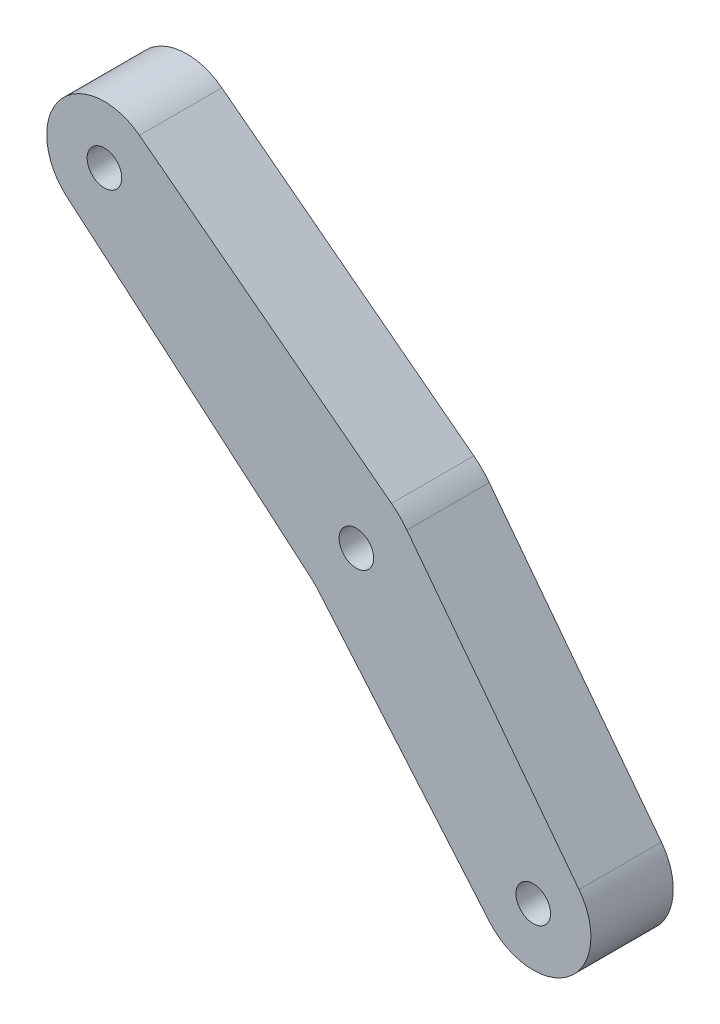
ISO-10303-21;
HEADER;
FILE_DESCRIPTION(('STEP AP214'),'2;1');
FILE_NAME('part.step','',(''),(''),'','','');
FILE_SCHEMA(('AUTOMOTIVE_DESIGN { 1 0 10303 214 1 1 1 1 }'));
ENDSEC;
DATA;
#1=APPLICATION_CONTEXT('core data for automotive mechanical design processes');
#2=APPLICATION_PROTOCOL_DEFINITION('international standard','automotive_design',2000,#1);
#3=PRODUCT_CONTEXT('',#1,'mechanical');
#4=PRODUCT('Part','Part','',(#3));
#5=PRODUCT_RELATED_PRODUCT_CATEGORY('part','',(#4));
#6=PRODUCT_DEFINITION_FORMATION('','',#4);
#7=PRODUCT_DEFINITION_CONTEXT('part definition',#1,'design');
#8=PRODUCT_DEFINITION('design','',#6,#7);
#9=PRODUCT_DEFINITION_SHAPE('','',#8);
#10=(LENGTH_UNIT() NAMED_UNIT(*) SI_UNIT(.MILLI.,.METRE.));
#11=(NAMED_UNIT(*) PLANE_ANGLE_UNIT() SI_UNIT($,.RADIAN.));
#12=(NAMED_UNIT(*) SI_UNIT($,.STERADIAN.) SOLID_ANGLE_UNIT());
#13=UNCERTAINTY_MEASURE_WITH_UNIT(LENGTH_MEASURE(1.E-05),#10,'distance_accuracy_value','');
#14=(GEOMETRIC_REPRESENTATION_CONTEXT(3) GLOBAL_UNCERTAINTY_ASSIGNED_CONTEXT((#13)) GLOBAL_UNIT_ASSIGNED_CONTEXT((#10,
#11,#12)) REPRESENTATION_CONTEXT('',''));
#15=CARTESIAN_POINT('',(0.,0.,0.));
#16=DIRECTION('',(0.,0.,1.));
#17=DIRECTION('',(1.,0.,0.));
#18=AXIS2_PLACEMENT_3D('',#15,#16,#17);
#19=CARTESIAN_POINT('',(-63.0537668880035,46.8405005939419,10.));
#20=DIRECTION('',(0.,0.,1.));
#21=DIRECTION('',(1.,0.,0.));
#22=AXIS2_PLACEMENT_3D('',#19,#20,#21);
#23=PLANE('',#22);
#24=CARTESIAN_POINT('',(-32.4724510234552,22.1569908736504,10.));
#25=DIRECTION('',(0.,0.,1.));
#26=DIRECTION('',(1.,0.,0.));
#27=AXIS2_PLACEMENT_3D('',#24,#25,#26);
#28=CIRCLE('',#27,2.1);
#29=CARTESIAN_POINT('',(-30.3724510234552,22.1569908736504,10.));
#30=VERTEX_POINT('',#29);
#31=EDGE_CURVE('E186',#30,#30,#28,.T.);
#32=ORIENTED_EDGE('',*,*,#31,.F.);
#33=EDGE_LOOP('',(#32));
#34=FACE_BOUND('',#33,.T.);
#35=CARTESIAN_POINT('',(-63.0537668880035,46.8405005939419,10.));
#36=DIRECTION('',(0.,0.,1.));
#37=DIRECTION('',(1.,0.,0.));
#38=AXIS2_PLACEMENT_3D('',#35,#36,#37);
#39=CIRCLE('',#38,7.00000000000004);
#40=CARTESIAN_POINT('',(-58.8013103124301,52.4007715471296,10.));
#41=VERTEX_POINT('',#40);
#42=CARTESIAN_POINT('',(-67.5913977169374,41.5104061801149,10.));
#43=VERTEX_POINT('',#42);
#44=EDGE_CURVE('E149',#41,#43,#39,.T.);
#45=ORIENTED_EDGE('',*,*,#44,.T.);
#46=DIRECTION('',(0.761442059118128,-0.648232975561985,0.));
#47=VECTOR('',#46,1.);
#48=CARTESIAN_POINT('',(-38.1456106432029,16.4425366764547,10.));
#49=LINE('',#48,#47);
#50=CARTESIAN_POINT('',(-38.1456106432029,16.4425366764547,10.));
#51=VERTEX_POINT('',#50);
#52=EDGE_CURVE('E97',#43,#51,#49,.T.);
#53=ORIENTED_EDGE('',*,*,#52,.T.);
#54=CARTESIAN_POINT('',(-44.6279403988221,8.82811608527413,10.));
#55=DIRECTION('',(0.,0.,-1.));
#56=DIRECTION('',(1.,0.,0.));
#57=AXIS2_PLACEMENT_3D('',#54,#55,#56);
#58=CIRCLE('',#57,9.99999999999906);
#59=CARTESIAN_POINT('',(-37.0116183844897,15.3082116844128,10.));
#60=VERTEX_POINT('',#59);
#61=EDGE_CURVE('E164',#51,#60,#58,.T.);
#62=ORIENTED_EDGE('',*,*,#61,.T.);
#63=DIRECTION('',(0.648009559913943,-0.761632201433302,0.));
#64=VECTOR('',#63,1.);
#65=CARTESIAN_POINT('',(-16.3314254100331,-8.9980669193976,10.));
#66=LINE('',#65,#64);
#67=CARTESIAN_POINT('',(-16.3314254100331,-8.99806691939761,10.));
#68=VERTEX_POINT('',#67);
#69=EDGE_CURVE('E177',#60,#68,#66,.T.);
#70=ORIENTED_EDGE('',*,*,#69,.T.);
#71=CARTESIAN_POINT('',(-11.,-4.462,10.));
#72=DIRECTION('',(0.,0.,1.));
#73=DIRECTION('',(-1.,0.,0.));
#74=AXIS2_PLACEMENT_3D('',#71,#72,#73);
#75=CIRCLE('',#74,7.);
#76=CARTESIAN_POINT('',(-5.43848172339126,-0.211174849638371,10.));
#77=VERTEX_POINT('',#76);
#78=EDGE_CURVE('E116',#68,#77,#75,.T.);
#79=ORIENTED_EDGE('',*,*,#78,.T.);
#80=DIRECTION('',(-0.607260735765947,0.794502610944105,0.));
#81=VECTOR('',#80,1.);
#82=CARTESIAN_POINT('',(-5.43848172339126,-0.211174849638371,10.));
#83=LINE('',#82,#81);
#84=CARTESIAN_POINT('',(-26.3383332016894,27.1329058555101,10.));
#85=VERTEX_POINT('',#84);
#86=EDGE_CURVE('E110',#77,#85,#83,.T.);
#87=ORIENTED_EDGE('',*,*,#86,.T.);
#88=CARTESIAN_POINT('',(-34.2833593111308,21.0602984978504,10.));
#89=DIRECTION('',(0.,0.,1.));
#90=DIRECTION('',(1.,0.,0.));
#91=AXIS2_PLACEMENT_3D('',#88,#89,#90);
#92=CIRCLE('',#91,10.0000000000004);
#93=CARTESIAN_POINT('',(-28.2084213460255,29.0035427166901,10.));
#94=VERTEX_POINT('',#93);
#95=EDGE_CURVE('E114',#85,#94,#92,.T.);
#96=ORIENTED_EDGE('',*,*,#95,.T.);
#97=DIRECTION('',(-0.794324421883945,0.607493796510497,0.));
#98=VECTOR('',#97,1.);
#99=CARTESIAN_POINT('',(-58.8013103124301,52.4007715471296,10.));
#100=LINE('',#99,#98);
#101=EDGE_CURVE('E54',#94,#41,#100,.T.);
#102=ORIENTED_EDGE('',*,*,#101,.T.);
#103=EDGE_LOOP('',(#45,#53,#62,#70,#79,#87,#96,#102));
#104=FACE_BOUND('',#103,.T.);
#105=CARTESIAN_POINT('',(-63.0537668880035,46.8405005939419,10.));
#106=DIRECTION('',(0.,0.,1.));
#107=DIRECTION('',(1.,0.,0.));
#108=AXIS2_PLACEMENT_3D('',#105,#106,#107);
#109=CIRCLE('',#108,2.1);
#110=CARTESIAN_POINT('',(-60.9537668880035,46.8405005939419,10.));
#111=VERTEX_POINT('',#110);
#112=EDGE_CURVE('E138',#111,#111,#109,.T.);
#113=ORIENTED_EDGE('',*,*,#112,.F.);
#114=EDGE_LOOP('',(#113));
#115=FACE_BOUND('',#114,.T.);
#116=CARTESIAN_POINT('',(-11.,-4.462,10.));
#117=DIRECTION('',(0.,0.,1.));
#118=DIRECTION('',(1.,0.,0.));
#119=AXIS2_PLACEMENT_3D('',#116,#117,#118);
#120=CIRCLE('',#119,2.1);
#121=CARTESIAN_POINT('',(-8.9,-4.462,10.));
#122=VERTEX_POINT('',#121);
#123=EDGE_CURVE('E192',#122,#122,#120,.T.);
#124=ORIENTED_EDGE('',*,*,#123,.F.);
#125=EDGE_LOOP('',(#124));
#126=FACE_BOUND('',#125,.T.);
#127=ADVANCED_FACE('F37',(#34,#104,#115,#126),#23,.T.);
#128=CARTESIAN_POINT('',(-63.0537668880035,46.8405005939419,0.));
#129=DIRECTION('',(0.,0.,1.));
#130=DIRECTION('',(1.,0.,0.));
#131=AXIS2_PLACEMENT_3D('',#128,#129,#130);
#132=PLANE('',#131);
#133=CARTESIAN_POINT('',(-63.0537668880035,46.8405005939419,0.));
#134=DIRECTION('',(0.,0.,1.));
#135=DIRECTION('',(1.,0.,0.));
#136=AXIS2_PLACEMENT_3D('',#133,#134,#135);
#137=CIRCLE('',#136,7.00000000000004);
#138=CARTESIAN_POINT('',(-58.8013103124301,52.4007715471296,0.));
#139=VERTEX_POINT('',#138);
#140=CARTESIAN_POINT('',(-67.5913977169374,41.5104061801149,0.));
#141=VERTEX_POINT('',#140);
#142=EDGE_CURVE('E134',#139,#141,#137,.T.);
#143=ORIENTED_EDGE('',*,*,#142,.F.);
#144=DIRECTION('',(-0.794324421883945,0.607493796510497,0.));
#145=VECTOR('',#144,1.);
#146=CARTESIAN_POINT('',(-58.8013103124301,52.4007715471296,0.));
#147=LINE('',#146,#145);
#148=CARTESIAN_POINT('',(-28.2084213460255,29.0035427166901,0.));
#149=VERTEX_POINT('',#148);
#150=EDGE_CURVE('E89',#149,#139,#147,.T.);
#151=ORIENTED_EDGE('',*,*,#150,.F.);
#152=CARTESIAN_POINT('',(-34.2833593111308,21.0602984978504,0.));
#153=DIRECTION('',(0.,0.,1.));
#154=DIRECTION('',(1.,0.,0.));
#155=AXIS2_PLACEMENT_3D('',#152,#153,#154);
#156=CIRCLE('',#155,10.0000000000004);
#157=CARTESIAN_POINT('',(-26.3383332016894,27.1329058555101,0.));
#158=VERTEX_POINT('',#157);
#159=EDGE_CURVE('E83',#158,#149,#156,.T.);
#160=ORIENTED_EDGE('',*,*,#159,.F.);
#161=DIRECTION('',(-0.607260735765947,0.794502610944105,0.));
#162=VECTOR('',#161,1.);
#163=CARTESIAN_POINT('',(-5.43848172339126,-0.211174849638371,0.));
#164=LINE('',#163,#162);
#165=CARTESIAN_POINT('',(-5.43848172339126,-0.211174849638371,0.));
#166=VERTEX_POINT('',#165);
#167=EDGE_CURVE('E124',#166,#158,#164,.T.);
#168=ORIENTED_EDGE('',*,*,#167,.F.);
#169=CARTESIAN_POINT('',(-11.,-4.462,0.));
#170=DIRECTION('',(0.,0.,1.));
#171=DIRECTION('',(-1.,0.,0.));
#172=AXIS2_PLACEMENT_3D('',#169,#170,#171);
#173=CIRCLE('',#172,7.);
#174=CARTESIAN_POINT('',(-16.3314254100331,-8.99806691939761,0.));
#175=VERTEX_POINT('',#174);
#176=EDGE_CURVE('E144',#175,#166,#173,.T.);
#177=ORIENTED_EDGE('',*,*,#176,.F.);
#178=DIRECTION('',(0.648009559913943,-0.761632201433302,0.));
#179=VECTOR('',#178,1.);
#180=CARTESIAN_POINT('',(-16.3314254100331,-8.9980669193976,0.));
#181=LINE('',#180,#179);
#182=CARTESIAN_POINT('',(-37.0116183844897,15.3082116844128,0.));
#183=VERTEX_POINT('',#182);
#184=EDGE_CURVE('E142',#183,#175,#181,.T.);
#185=ORIENTED_EDGE('',*,*,#184,.F.);
#186=CARTESIAN_POINT('',(-44.6279403988221,8.82811608527413,0.));
#187=DIRECTION('',(0.,0.,-1.));
#188=DIRECTION('',(1.,0.,0.));
#189=AXIS2_PLACEMENT_3D('',#186,#187,#188);
#190=CIRCLE('',#189,9.99999999999906);
#191=CARTESIAN_POINT('',(-38.1456106432029,16.4425366764547,0.));
#192=VERTEX_POINT('',#191);
#193=EDGE_CURVE('E140',#192,#183,#190,.T.);
#194=ORIENTED_EDGE('',*,*,#193,.F.);
#195=DIRECTION('',(0.761442059118128,-0.648232975561985,0.));
#196=VECTOR('',#195,1.);
#197=CARTESIAN_POINT('',(-38.1456106432029,16.4425366764547,0.));
#198=LINE('',#197,#196);
#199=EDGE_CURVE('E137',#141,#192,#198,.T.);
#200=ORIENTED_EDGE('',*,*,#199,.F.);
#201=EDGE_LOOP('',(#143,#151,#160,#168,#177,#185,#194,#200));
#202=FACE_BOUND('',#201,.T.);
#203=CARTESIAN_POINT('',(-63.0537668880035,46.8405005939419,0.));
#204=DIRECTION('',(0.,0.,1.));
#205=DIRECTION('',(1.,0.,0.));
#206=AXIS2_PLACEMENT_3D('',#203,#204,#205);
#207=CIRCLE('',#206,2.1);
#208=CARTESIAN_POINT('',(-60.9537668880035,46.8405005939419,0.));
#209=VERTEX_POINT('',#208);
#210=EDGE_CURVE('E183',#209,#209,#207,.T.);
#211=ORIENTED_EDGE('',*,*,#210,.T.);
#212=EDGE_LOOP('',(#211));
#213=FACE_BOUND('',#212,.T.);
#214=CARTESIAN_POINT('',(-32.4724510234552,22.1569908736504,0.));
#215=DIRECTION('',(0.,0.,1.));
#216=DIRECTION('',(1.,0.,0.));
#217=AXIS2_PLACEMENT_3D('',#214,#215,#216);
#218=CIRCLE('',#217,2.1);
#219=CARTESIAN_POINT('',(-30.3724510234552,22.1569908736504,0.));
#220=VERTEX_POINT('',#219);
#221=EDGE_CURVE('E189',#220,#220,#218,.T.);
#222=ORIENTED_EDGE('',*,*,#221,.T.);
#223=EDGE_LOOP('',(#222));
#224=FACE_BOUND('',#223,.T.);
#225=CARTESIAN_POINT('',(-11.,-4.462,0.));
#226=DIRECTION('',(0.,0.,1.));
#227=DIRECTION('',(1.,0.,0.));
#228=AXIS2_PLACEMENT_3D('',#225,#226,#227);
#229=CIRCLE('',#228,2.1);
#230=CARTESIAN_POINT('',(-8.9,-4.462,0.));
#231=VERTEX_POINT('',#230);
#232=EDGE_CURVE('E195',#231,#231,#229,.T.);
#233=ORIENTED_EDGE('',*,*,#232,.T.);
#234=EDGE_LOOP('',(#233));
#235=FACE_BOUND('',#234,.T.);
#236=ADVANCED_FACE('F168',(#202,#213,#224,#235),#132,.F.);
#237=CARTESIAN_POINT('',(-63.0537668880035,46.8405005939419,10.));
#238=DIRECTION('',(0.,0.,-1.));
#239=DIRECTION('',(-1.,0.,0.));
#240=AXIS2_PLACEMENT_3D('',#237,#238,#239);
#241=CYLINDRICAL_SURFACE('',#240,7.00000000000004);
#242=ORIENTED_EDGE('',*,*,#142,.T.);
#243=DIRECTION('',(0.,0.,-1.));
#244=VECTOR('',#243,1.);
#245=CARTESIAN_POINT('',(-67.5913977169374,41.5104061801149,10.));
#246=LINE('',#245,#244);
#247=EDGE_CURVE('E11',#43,#141,#246,.T.);
#248=ORIENTED_EDGE('',*,*,#247,.F.);
#249=ORIENTED_EDGE('',*,*,#44,.F.);
#250=DIRECTION('',(0.,0.,-1.));
#251=VECTOR('',#250,1.);
#252=CARTESIAN_POINT('',(-58.8013103124301,52.4007715471296,10.));
#253=LINE('',#252,#251);
#254=EDGE_CURVE('E130',#41,#139,#253,.T.);
#255=ORIENTED_EDGE('',*,*,#254,.T.);
#256=EDGE_LOOP('',(#242,#248,#249,#255));
#257=FACE_BOUND('',#256,.T.);
#258=ADVANCED_FACE('F39',(#257),#241,.T.);
#259=CARTESIAN_POINT('',(-38.1456106432029,16.4425366764547,10.));
#260=DIRECTION('',(0.648232975561985,0.761442059118128,0.));
#261=DIRECTION('',(-0.761442059118128,0.648232975561985,0.));
#262=AXIS2_PLACEMENT_3D('',#259,#260,#261);
#263=PLANE('',#262);
#264=ORIENTED_EDGE('',*,*,#199,.T.);
#265=DIRECTION('',(0.,0.,-1.));
#266=VECTOR('',#265,1.);
#267=CARTESIAN_POINT('',(-38.1456106432029,16.4425366764547,10.));
#268=LINE('',#267,#266);
#269=EDGE_CURVE('E46',#51,#192,#268,.T.);
#270=ORIENTED_EDGE('',*,*,#269,.F.);
#271=ORIENTED_EDGE('',*,*,#52,.F.);
#272=ORIENTED_EDGE('',*,*,#247,.T.);
#273=EDGE_LOOP('',(#264,#270,#271,#272));
#274=FACE_BOUND('',#273,.T.);
#275=ADVANCED_FACE('F228',(#274),#263,.F.);
#276=CARTESIAN_POINT('',(-44.6279403988221,8.82811608527413,10.));
#277=DIRECTION('',(0.,0.,-1.));
#278=DIRECTION('',(-1.,0.,0.));
#279=AXIS2_PLACEMENT_3D('',#276,#277,#278);
#280=CYLINDRICAL_SURFACE('',#279,9.99999999999906);
#281=ORIENTED_EDGE('',*,*,#193,.T.);
#282=DIRECTION('',(0.,0.,-1.));
#283=VECTOR('',#282,1.);
#284=CARTESIAN_POINT('',(-37.0116183844897,15.3082116844128,10.));
#285=LINE('',#284,#283);
#286=EDGE_CURVE('E156',#60,#183,#285,.T.);
#287=ORIENTED_EDGE('',*,*,#286,.F.);
#288=ORIENTED_EDGE('',*,*,#61,.F.);
#289=ORIENTED_EDGE('',*,*,#269,.T.);
#290=EDGE_LOOP('',(#281,#287,#288,#289));
#291=FACE_BOUND('',#290,.T.);
#292=ADVANCED_FACE('F162',(#291),#280,.F.);
#293=CARTESIAN_POINT('',(-16.3314254100331,-8.9980669193976,10.));
#294=DIRECTION('',(0.761632201433302,0.648009559913943,0.));
#295=DIRECTION('',(-0.648009559913943,0.761632201433302,0.));
#296=AXIS2_PLACEMENT_3D('',#293,#294,#295);
#297=PLANE('',#296);
#298=ORIENTED_EDGE('',*,*,#184,.T.);
#299=DIRECTION('',(0.,0.,-1.));
#300=VECTOR('',#299,1.);
#301=CARTESIAN_POINT('',(-16.3314254100331,-8.99806691939761,10.));
#302=LINE('',#301,#300);
#303=EDGE_CURVE('E153',#68,#175,#302,.T.);
#304=ORIENTED_EDGE('',*,*,#303,.F.);
#305=ORIENTED_EDGE('',*,*,#69,.F.);
#306=ORIENTED_EDGE('',*,*,#286,.T.);
#307=EDGE_LOOP('',(#298,#304,#305,#306));
#308=FACE_BOUND('',#307,.T.);
#309=ADVANCED_FACE('F173',(#308),#297,.F.);
#310=CARTESIAN_POINT('',(-11.,-4.462,10.));
#311=DIRECTION('',(0.,0.,-1.));
#312=DIRECTION('',(-1.,0.,0.));
#313=AXIS2_PLACEMENT_3D('',#310,#311,#312);
#314=CYLINDRICAL_SURFACE('',#313,7.);
#315=ORIENTED_EDGE('',*,*,#176,.T.);
#316=DIRECTION('',(0.,0.,-1.));
#317=VECTOR('',#316,1.);
#318=CARTESIAN_POINT('',(-5.43848172339126,-0.211174849638371,10.));
#319=LINE('',#318,#317);
#320=EDGE_CURVE('E125',#77,#166,#319,.T.);
#321=ORIENTED_EDGE('',*,*,#320,.F.);
#322=ORIENTED_EDGE('',*,*,#78,.F.);
#323=ORIENTED_EDGE('',*,*,#303,.T.);
#324=EDGE_LOOP('',(#315,#321,#322,#323));
#325=FACE_BOUND('',#324,.T.);
#326=ADVANCED_FACE('F176',(#325),#314,.T.);
#327=CARTESIAN_POINT('',(-5.43848172339126,-0.211174849638371,10.));
#328=DIRECTION('',(-0.794502610944105,-0.607260735765947,0.));
#329=DIRECTION('',(0.607260735765947,-0.794502610944106,0.));
#330=AXIS2_PLACEMENT_3D('',#327,#328,#329);
#331=PLANE('',#330);
#332=ORIENTED_EDGE('',*,*,#167,.T.);
#333=DIRECTION('',(0.,0.,-1.));
#334=VECTOR('',#333,1.);
#335=CARTESIAN_POINT('',(-26.3383332016894,27.1329058555101,10.));
#336=LINE('',#335,#334);
#337=EDGE_CURVE('E121',#85,#158,#336,.T.);
#338=ORIENTED_EDGE('',*,*,#337,.F.);
#339=ORIENTED_EDGE('',*,*,#86,.F.);
#340=ORIENTED_EDGE('',*,*,#320,.T.);
#341=EDGE_LOOP('',(#332,#338,#339,#340));
#342=FACE_BOUND('',#341,.T.);
#343=ADVANCED_FACE('F122',(#342),#331,.F.);
#344=CARTESIAN_POINT('',(-34.2833593111308,21.0602984978504,10.));
#345=DIRECTION('',(0.,0.,-1.));
#346=DIRECTION('',(-1.,0.,0.));
#347=AXIS2_PLACEMENT_3D('',#344,#345,#346);
#348=CYLINDRICAL_SURFACE('',#347,10.0000000000004);
#349=ORIENTED_EDGE('',*,*,#159,.T.);
#350=DIRECTION('',(0.,0.,-1.));
#351=VECTOR('',#350,1.);
#352=CARTESIAN_POINT('',(-28.2084213460255,29.0035427166901,10.));
#353=LINE('',#352,#351);
#354=EDGE_CURVE('E126',#94,#149,#353,.T.);
#355=ORIENTED_EDGE('',*,*,#354,.F.);
#356=ORIENTED_EDGE('',*,*,#95,.F.);
#357=ORIENTED_EDGE('',*,*,#337,.T.);
#358=EDGE_LOOP('',(#349,#355,#356,#357));
#359=FACE_BOUND('',#358,.T.);
#360=ADVANCED_FACE('F128',(#359),#348,.T.);
#361=CARTESIAN_POINT('',(-58.8013103124301,52.4007715471296,10.));
#362=DIRECTION('',(-0.607493796510497,-0.794324421883945,0.));
#363=DIRECTION('',(0.794324421883945,-0.607493796510497,0.));
#364=AXIS2_PLACEMENT_3D('',#361,#362,#363);
#365=PLANE('',#364);
#366=ORIENTED_EDGE('',*,*,#150,.T.);
#367=ORIENTED_EDGE('',*,*,#254,.F.);
#368=ORIENTED_EDGE('',*,*,#101,.F.);
#369=ORIENTED_EDGE('',*,*,#354,.T.);
#370=EDGE_LOOP('',(#366,#367,#368,#369));
#371=FACE_BOUND('',#370,.T.);
#372=ADVANCED_FACE('F216',(#371),#365,.F.);
#373=CARTESIAN_POINT('',(-63.0537668880035,46.8405005939419,10.));
#374=DIRECTION('',(0.,0.,-1.));
#375=DIRECTION('',(-1.,0.,0.));
#376=AXIS2_PLACEMENT_3D('',#373,#374,#375);
#377=CYLINDRICAL_SURFACE('',#376,2.1);
#378=ORIENTED_EDGE('',*,*,#112,.T.);
#379=EDGE_LOOP('',(#378));
#380=FACE_BOUND('',#379,.T.);
#381=ORIENTED_EDGE('',*,*,#210,.F.);
#382=EDGE_LOOP('',(#381));
#383=FACE_BOUND('',#382,.T.);
#384=ADVANCED_FACE('F213',(#380,#383),#377,.F.);
#385=CARTESIAN_POINT('',(-32.4724510234552,22.1569908736504,10.));
#386=DIRECTION('',(0.,0.,-1.));
#387=DIRECTION('',(-1.,0.,0.));
#388=AXIS2_PLACEMENT_3D('',#385,#386,#387);
#389=CYLINDRICAL_SURFACE('',#388,2.1);
#390=ORIENTED_EDGE('',*,*,#31,.T.);
#391=EDGE_LOOP('',(#390));
#392=FACE_BOUND('',#391,.T.);
#393=ORIENTED_EDGE('',*,*,#221,.F.);
#394=EDGE_LOOP('',(#393));
#395=FACE_BOUND('',#394,.T.);
#396=ADVANCED_FACE('F304',(#392,#395),#389,.F.);
#397=CARTESIAN_POINT('',(-11.,-4.462,10.));
#398=DIRECTION('',(0.,0.,-1.));
#399=DIRECTION('',(-1.,0.,0.));
#400=AXIS2_PLACEMENT_3D('',#397,#398,#399);
#401=CYLINDRICAL_SURFACE('',#400,2.1);
#402=ORIENTED_EDGE('',*,*,#123,.T.);
#403=EDGE_LOOP('',(#402));
#404=FACE_BOUND('',#403,.T.);
#405=ORIENTED_EDGE('',*,*,#232,.F.);
#406=EDGE_LOOP('',(#405));
#407=FACE_BOUND('',#406,.T.);
#408=ADVANCED_FACE('F201',(#404,#407),#401,.F.);
#409=CLOSED_SHELL('',(#127,#236,#258,#275,#292,#309,#326,#343,#360,#372,#384,#396,#408));
#410=MANIFOLD_SOLID_BREP('B2',#409);
#411=ADVANCED_BREP_SHAPE_REPRESENTATION('',(#18,#410),#14);
#412=SHAPE_DEFINITION_REPRESENTATION(#9,#411);
ENDSEC;
END-ISO-10303-21;
